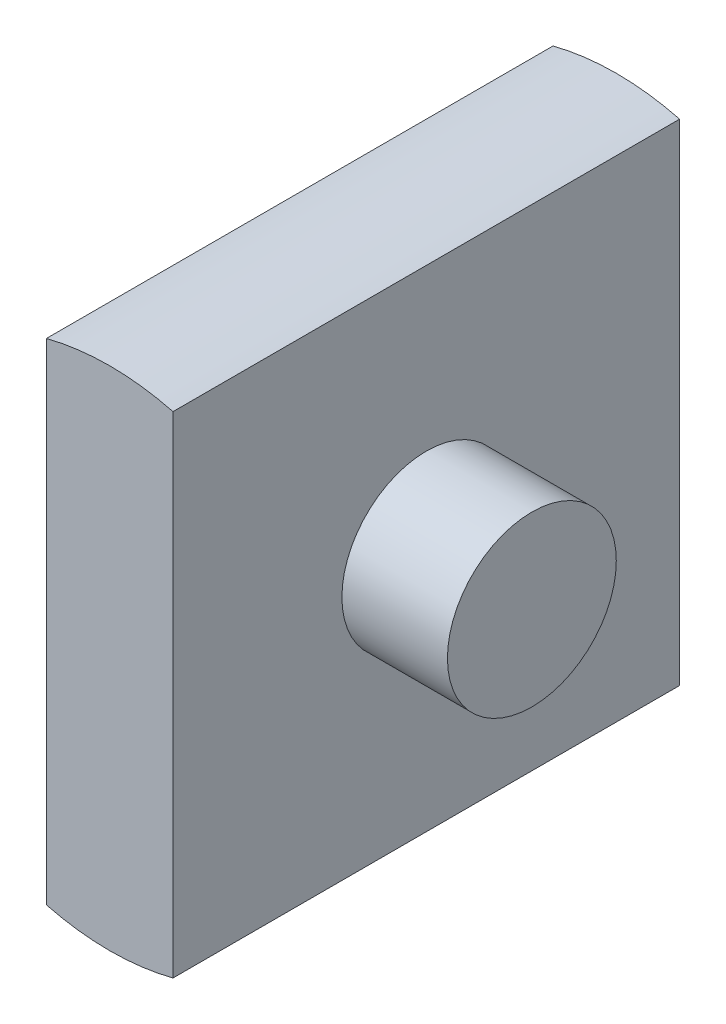
ISO-10303-21;
HEADER;
FILE_DESCRIPTION(('STEP AP214'),'2;1');
FILE_NAME('part.step','',(''),(''),'','','');
FILE_SCHEMA(('AUTOMOTIVE_DESIGN { 1 0 10303 214 1 1 1 1 }'));
ENDSEC;
DATA;
#1=APPLICATION_CONTEXT('core data for automotive mechanical design processes');
#2=APPLICATION_PROTOCOL_DEFINITION('international standard','automotive_design',2000,#1);
#3=PRODUCT_CONTEXT('',#1,'mechanical');
#4=PRODUCT('Part','Part','',(#3));
#5=PRODUCT_RELATED_PRODUCT_CATEGORY('part','',(#4));
#6=PRODUCT_DEFINITION_FORMATION('','',#4);
#7=PRODUCT_DEFINITION_CONTEXT('part definition',#1,'design');
#8=PRODUCT_DEFINITION('design','',#6,#7);
#9=PRODUCT_DEFINITION_SHAPE('','',#8);
#10=(LENGTH_UNIT() NAMED_UNIT(*) SI_UNIT(.MILLI.,.METRE.));
#11=(NAMED_UNIT(*) PLANE_ANGLE_UNIT() SI_UNIT($,.RADIAN.));
#12=(NAMED_UNIT(*) SI_UNIT($,.STERADIAN.) SOLID_ANGLE_UNIT());
#13=UNCERTAINTY_MEASURE_WITH_UNIT(LENGTH_MEASURE(1.E-05),#10,'distance_accuracy_value','');
#14=(GEOMETRIC_REPRESENTATION_CONTEXT(3) GLOBAL_UNCERTAINTY_ASSIGNED_CONTEXT((#13)) GLOBAL_UNIT_ASSIGNED_CONTEXT((#10,
#11,#12)) REPRESENTATION_CONTEXT('',''));
#15=CARTESIAN_POINT('',(0.,0.,0.));
#16=DIRECTION('',(0.,0.,1.));
#17=DIRECTION('',(1.,0.,0.));
#18=AXIS2_PLACEMENT_3D('',#15,#16,#17);
#19=CARTESIAN_POINT('',(0.,0.,60.));
#20=DIRECTION('',(0.,0.,-1.));
#21=DIRECTION('',(-1.,0.,0.));
#22=AXIS2_PLACEMENT_3D('',#19,#20,#21);
#23=CYLINDRICAL_SURFACE('',#22,30.);
#24=CARTESIAN_POINT('',(0.,0.,0.));
#25=DIRECTION('',(0.,0.,1.));
#26=DIRECTION('',(1.,0.,0.));
#27=AXIS2_PLACEMENT_3D('',#24,#25,#26);
#28=CIRCLE('',#27,30.);
#29=CARTESIAN_POINT('',(7.5,29.0473750965556,0.));
#30=VERTEX_POINT('',#29);
#31=CARTESIAN_POINT('',(-7.5,29.0473750965556,0.));
#32=VERTEX_POINT('',#31);
#33=EDGE_CURVE('E102',#30,#32,#28,.T.);
#34=ORIENTED_EDGE('',*,*,#33,.T.);
#35=DIRECTION('',(0.,0.,-1.));
#36=VECTOR('',#35,1.);
#37=CARTESIAN_POINT('',(-7.5,29.0473750965556,60.));
#38=LINE('',#37,#36);
#39=CARTESIAN_POINT('',(-7.5,29.0473750965556,60.));
#40=VERTEX_POINT('',#39);
#41=EDGE_CURVE('E93',#40,#32,#38,.T.);
#42=ORIENTED_EDGE('',*,*,#41,.F.);
#43=CARTESIAN_POINT('',(0.,0.,60.));
#44=DIRECTION('',(0.,0.,1.));
#45=DIRECTION('',(1.,0.,0.));
#46=AXIS2_PLACEMENT_3D('',#43,#44,#45);
#47=CIRCLE('',#46,30.);
#48=CARTESIAN_POINT('',(7.5,29.0473750965556,60.));
#49=VERTEX_POINT('',#48);
#50=EDGE_CURVE('E87',#49,#40,#47,.T.);
#51=ORIENTED_EDGE('',*,*,#50,.F.);
#52=DIRECTION('',(0.,0.,-1.));
#53=VECTOR('',#52,1.);
#54=CARTESIAN_POINT('',(7.5,29.0473750965556,60.));
#55=LINE('',#54,#53);
#56=EDGE_CURVE('E98',#49,#30,#55,.T.);
#57=ORIENTED_EDGE('',*,*,#56,.T.);
#58=EDGE_LOOP('',(#34,#42,#51,#57));
#59=FACE_BOUND('',#58,.T.);
#60=ADVANCED_FACE('F34',(#59),#23,.T.);
#61=CARTESIAN_POINT('',(-7.5,29.0473750965556,60.));
#62=DIRECTION('',(1.,0.,0.));
#63=DIRECTION('',(0.,0.,-1.));
#64=AXIS2_PLACEMENT_3D('',#61,#62,#63);
#65=PLANE('',#64);
#66=CARTESIAN_POINT('',(-7.5,0.,30.));
#67=DIRECTION('',(1.,0.,0.));
#68=DIRECTION('',(0.,0.,-1.));
#69=AXIS2_PLACEMENT_3D('',#66,#67,#68);
#70=CIRCLE('',#69,10.);
#71=CARTESIAN_POINT('',(-7.5,0.,20.));
#72=VERTEX_POINT('',#71);
#73=EDGE_CURVE('E11',#72,#72,#70,.F.);
#74=ORIENTED_EDGE('',*,*,#73,.F.);
#75=EDGE_LOOP('',(#74));
#76=FACE_BOUND('',#75,.T.);
#77=DIRECTION('',(0.,-1.,0.));
#78=VECTOR('',#77,1.);
#79=CARTESIAN_POINT('',(-7.5,29.0473750965556,0.));
#80=LINE('',#79,#78);
#81=CARTESIAN_POINT('',(-7.50000000000001,-29.0473750965556,0.));
#82=VERTEX_POINT('',#81);
#83=EDGE_CURVE('E92',#32,#82,#80,.T.);
#84=ORIENTED_EDGE('',*,*,#83,.T.);
#85=DIRECTION('',(0.,0.,-1.));
#86=VECTOR('',#85,1.);
#87=CARTESIAN_POINT('',(-7.50000000000001,-29.0473750965556,60.));
#88=LINE('',#87,#86);
#89=CARTESIAN_POINT('',(-7.50000000000001,-29.0473750965556,60.));
#90=VERTEX_POINT('',#89);
#91=EDGE_CURVE('E90',#90,#82,#88,.T.);
#92=ORIENTED_EDGE('',*,*,#91,.F.);
#93=DIRECTION('',(0.,-1.,0.));
#94=VECTOR('',#93,1.);
#95=CARTESIAN_POINT('',(-7.5,29.0473750965556,60.));
#96=LINE('',#95,#94);
#97=EDGE_CURVE('E82',#40,#90,#96,.T.);
#98=ORIENTED_EDGE('',*,*,#97,.F.);
#99=ORIENTED_EDGE('',*,*,#41,.T.);
#100=EDGE_LOOP('',(#84,#92,#98,#99));
#101=FACE_BOUND('',#100,.T.);
#102=ADVANCED_FACE('F91',(#76,#101),#65,.F.);
#103=CARTESIAN_POINT('',(0.,0.,60.));
#104=DIRECTION('',(0.,0.,-1.));
#105=DIRECTION('',(-1.,0.,0.));
#106=AXIS2_PLACEMENT_3D('',#103,#104,#105);
#107=CYLINDRICAL_SURFACE('',#106,30.);
#108=CARTESIAN_POINT('',(0.,0.,0.));
#109=DIRECTION('',(0.,0.,1.));
#110=DIRECTION('',(1.,0.,0.));
#111=AXIS2_PLACEMENT_3D('',#108,#109,#110);
#112=CIRCLE('',#111,30.);
#113=CARTESIAN_POINT('',(7.5,-29.0473750965556,0.));
#114=VERTEX_POINT('',#113);
#115=EDGE_CURVE('E68',#82,#114,#112,.T.);
#116=ORIENTED_EDGE('',*,*,#115,.T.);
#117=DIRECTION('',(0.,0.,-1.));
#118=VECTOR('',#117,1.);
#119=CARTESIAN_POINT('',(7.5,-29.0473750965556,60.));
#120=LINE('',#119,#118);
#121=CARTESIAN_POINT('',(7.5,-29.0473750965556,60.));
#122=VERTEX_POINT('',#121);
#123=EDGE_CURVE('E94',#122,#114,#120,.T.);
#124=ORIENTED_EDGE('',*,*,#123,.F.);
#125=CARTESIAN_POINT('',(0.,0.,60.));
#126=DIRECTION('',(0.,0.,1.));
#127=DIRECTION('',(1.,0.,0.));
#128=AXIS2_PLACEMENT_3D('',#125,#126,#127);
#129=CIRCLE('',#128,30.);
#130=EDGE_CURVE('E85',#90,#122,#129,.T.);
#131=ORIENTED_EDGE('',*,*,#130,.F.);
#132=ORIENTED_EDGE('',*,*,#91,.T.);
#133=EDGE_LOOP('',(#116,#124,#131,#132));
#134=FACE_BOUND('',#133,.T.);
#135=ADVANCED_FACE('F96',(#134),#107,.T.);
#136=CARTESIAN_POINT('',(7.5,29.0473750965556,60.));
#137=DIRECTION('',(-1.,0.,0.));
#138=DIRECTION('',(0.,0.,1.));
#139=AXIS2_PLACEMENT_3D('',#136,#137,#138);
#140=PLANE('',#139);
#141=CARTESIAN_POINT('',(7.5,0.,30.));
#142=DIRECTION('',(-1.,0.,0.));
#143=DIRECTION('',(0.,0.,1.));
#144=AXIS2_PLACEMENT_3D('',#141,#142,#143);
#145=CIRCLE('',#144,10.);
#146=CARTESIAN_POINT('',(7.5,0.,40.));
#147=VERTEX_POINT('',#146);
#148=EDGE_CURVE('E37',#147,#147,#145,.F.);
#149=ORIENTED_EDGE('',*,*,#148,.F.);
#150=EDGE_LOOP('',(#149));
#151=FACE_BOUND('',#150,.T.);
#152=DIRECTION('',(0.,1.,0.));
#153=VECTOR('',#152,1.);
#154=CARTESIAN_POINT('',(7.5,29.0473750965556,0.));
#155=LINE('',#154,#153);
#156=EDGE_CURVE('E74',#114,#30,#155,.T.);
#157=ORIENTED_EDGE('',*,*,#156,.T.);
#158=ORIENTED_EDGE('',*,*,#56,.F.);
#159=DIRECTION('',(0.,1.,0.));
#160=VECTOR('',#159,1.);
#161=CARTESIAN_POINT('',(7.5,29.0473750965556,60.));
#162=LINE('',#161,#160);
#163=EDGE_CURVE('E51',#122,#49,#162,.T.);
#164=ORIENTED_EDGE('',*,*,#163,.F.);
#165=ORIENTED_EDGE('',*,*,#123,.T.);
#166=EDGE_LOOP('',(#157,#158,#164,#165));
#167=FACE_BOUND('',#166,.T.);
#168=ADVANCED_FACE('F115',(#151,#167),#140,.F.);
#169=CARTESIAN_POINT('',(0.,0.,60.));
#170=DIRECTION('',(0.,0.,1.));
#171=DIRECTION('',(1.,0.,0.));
#172=AXIS2_PLACEMENT_3D('',#169,#170,#171);
#173=PLANE('',#172);
#174=ORIENTED_EDGE('',*,*,#50,.T.);
#175=ORIENTED_EDGE('',*,*,#97,.T.);
#176=ORIENTED_EDGE('',*,*,#130,.T.);
#177=ORIENTED_EDGE('',*,*,#163,.T.);
#178=EDGE_LOOP('',(#174,#175,#176,#177));
#179=FACE_BOUND('',#178,.T.);
#180=ADVANCED_FACE('F83',(#179),#173,.T.);
#181=CARTESIAN_POINT('',(0.,0.,0.));
#182=DIRECTION('',(0.,0.,1.));
#183=DIRECTION('',(1.,0.,0.));
#184=AXIS2_PLACEMENT_3D('',#181,#182,#183);
#185=PLANE('',#184);
#186=ORIENTED_EDGE('',*,*,#33,.F.);
#187=ORIENTED_EDGE('',*,*,#156,.F.);
#188=ORIENTED_EDGE('',*,*,#115,.F.);
#189=ORIENTED_EDGE('',*,*,#83,.F.);
#190=EDGE_LOOP('',(#186,#187,#188,#189));
#191=FACE_BOUND('',#190,.T.);
#192=ADVANCED_FACE('F122',(#191),#185,.F.);
#193=CARTESIAN_POINT('',(20.,0.,30.));
#194=DIRECTION('',(1.,0.,0.));
#195=DIRECTION('',(0.,0.,-1.));
#196=AXIS2_PLACEMENT_3D('',#193,#194,#195);
#197=PLANE('',#196);
#198=CARTESIAN_POINT('',(20.,0.,30.));
#199=DIRECTION('',(1.,0.,0.));
#200=DIRECTION('',(0.,0.,-1.));
#201=AXIS2_PLACEMENT_3D('',#198,#199,#200);
#202=CIRCLE('',#201,10.);
#203=CARTESIAN_POINT('',(20.,0.,20.));
#204=VERTEX_POINT('',#203);
#205=EDGE_CURVE('E105',#204,#204,#202,.T.);
#206=ORIENTED_EDGE('',*,*,#205,.T.);
#207=EDGE_LOOP('',(#206));
#208=FACE_BOUND('',#207,.T.);
#209=ADVANCED_FACE('F135',(#208),#197,.T.);
#210=CARTESIAN_POINT('',(20.,0.,30.));
#211=DIRECTION('',(-1.,0.,0.));
#212=DIRECTION('',(0.,0.,1.));
#213=AXIS2_PLACEMENT_3D('',#210,#211,#212);
#214=CYLINDRICAL_SURFACE('',#213,10.);
#215=ORIENTED_EDGE('',*,*,#205,.F.);
#216=EDGE_LOOP('',(#215));
#217=FACE_BOUND('',#216,.T.);
#218=ORIENTED_EDGE('',*,*,#148,.T.);
#219=EDGE_LOOP('',(#218));
#220=FACE_BOUND('',#219,.T.);
#221=ADVANCED_FACE('F113',(#217,#220),#214,.T.);
#222=CARTESIAN_POINT('',(-20.,0.,30.));
#223=DIRECTION('',(1.,0.,0.));
#224=DIRECTION('',(0.,0.,-1.));
#225=AXIS2_PLACEMENT_3D('',#222,#223,#224);
#226=CIRCLE('',#225,10.);
#227=CARTESIAN_POINT('',(-20.,0.,20.));
#228=VERTEX_POINT('',#227);
#229=EDGE_CURVE('E153',#228,#228,#226,.T.);
#230=ORIENTED_EDGE('',*,*,#229,.T.);
#231=EDGE_LOOP('',(#230));
#232=FACE_BOUND('',#231,.T.);
#233=ORIENTED_EDGE('',*,*,#73,.T.);
#234=EDGE_LOOP('',(#233));
#235=FACE_BOUND('',#234,.T.);
#236=ADVANCED_FACE('F142',(#232,#235),#214,.T.);
#237=CARTESIAN_POINT('',(-20.,0.,30.));
#238=DIRECTION('',(1.,0.,0.));
#239=DIRECTION('',(0.,0.,-1.));
#240=AXIS2_PLACEMENT_3D('',#237,#238,#239);
#241=PLANE('',#240);
#242=ORIENTED_EDGE('',*,*,#229,.F.);
#243=EDGE_LOOP('',(#242));
#244=FACE_BOUND('',#243,.T.);
#245=ADVANCED_FACE('F145',(#244),#241,.F.);
#246=CLOSED_SHELL('',(#60,#102,#135,#168,#180,#192,#209,#221,#236,#245));
#247=MANIFOLD_SOLID_BREP('B2',#246);
#248=ADVANCED_BREP_SHAPE_REPRESENTATION('',(#18,#247),#14);
#249=SHAPE_DEFINITION_REPRESENTATION(#9,#248);
ENDSEC;
END-ISO-10303-21;
